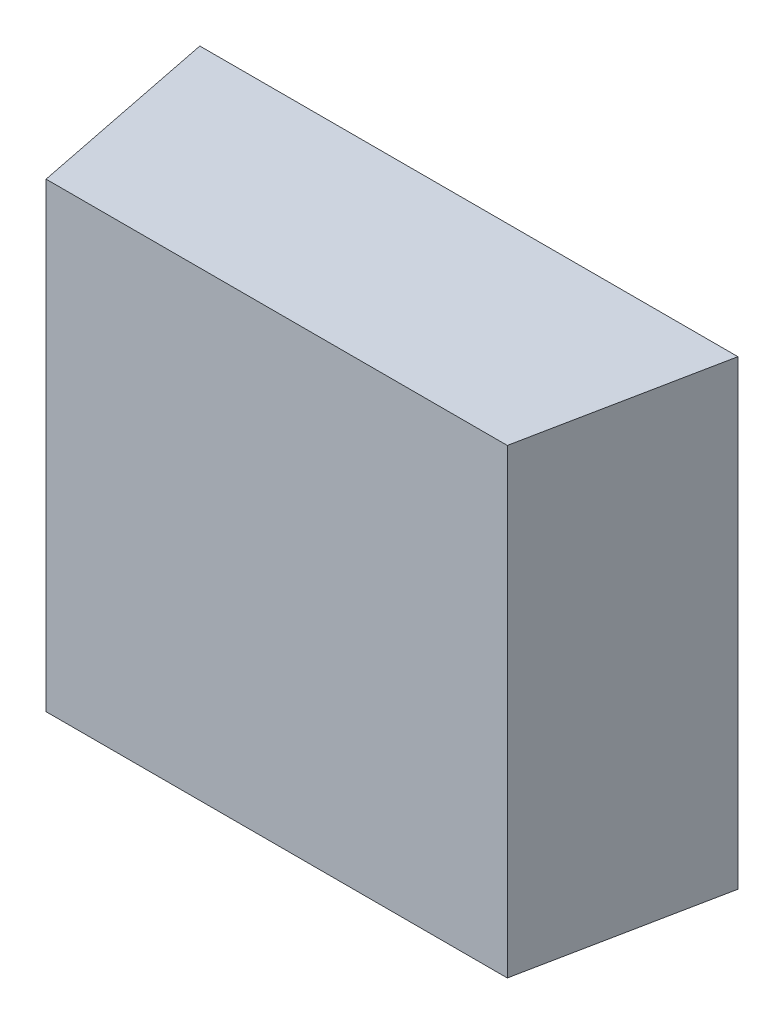
ISO-10303-21;
HEADER;
FILE_DESCRIPTION(('STEP AP214'),'2;1');
FILE_NAME('part.step','',(''),(''),'','','');
FILE_SCHEMA(('AUTOMOTIVE_DESIGN { 1 0 10303 214 1 1 1 1 }'));
ENDSEC;
DATA;
#1=APPLICATION_CONTEXT('core data for automotive mechanical design processes');
#2=APPLICATION_PROTOCOL_DEFINITION('international standard','automotive_design',2000,#1);
#3=PRODUCT_CONTEXT('',#1,'mechanical');
#4=PRODUCT('Part','Part','',(#3));
#5=PRODUCT_RELATED_PRODUCT_CATEGORY('part','',(#4));
#6=PRODUCT_DEFINITION_FORMATION('','',#4);
#7=PRODUCT_DEFINITION_CONTEXT('part definition',#1,'design');
#8=PRODUCT_DEFINITION('design','',#6,#7);
#9=PRODUCT_DEFINITION_SHAPE('','',#8);
#10=(LENGTH_UNIT() NAMED_UNIT(*) SI_UNIT(.MILLI.,.METRE.));
#11=(NAMED_UNIT(*) PLANE_ANGLE_UNIT() SI_UNIT($,.RADIAN.));
#12=(NAMED_UNIT(*) SI_UNIT($,.STERADIAN.) SOLID_ANGLE_UNIT());
#13=UNCERTAINTY_MEASURE_WITH_UNIT(LENGTH_MEASURE(1.E-05),#10,'distance_accuracy_value','');
#14=(GEOMETRIC_REPRESENTATION_CONTEXT(3) GLOBAL_UNCERTAINTY_ASSIGNED_CONTEXT((#13)) GLOBAL_UNIT_ASSIGNED_CONTEXT((#10,
#11,#12)) REPRESENTATION_CONTEXT('',''));
#15=CARTESIAN_POINT('',(0.,0.,0.));
#16=DIRECTION('',(0.,0.,1.));
#17=DIRECTION('',(1.,0.,0.));
#18=AXIS2_PLACEMENT_3D('',#15,#16,#17);
#19=CARTESIAN_POINT('',(0.0339143213787585,-0.927979057558617,0.0911708661417334));
#20=DIRECTION('',(0.,0.,-1.));
#21=DIRECTION('',(-1.,0.,0.));
#22=AXIS2_PLACEMENT_3D('',#19,#20,#21);
#23=PLANE('',#22);
#24=DIRECTION('',(0.,1.,0.));
#25=VECTOR('',#24,1.);
#26=CARTESIAN_POINT('',(0.0358749513000183,-0.927979057558617,0.0911708661417334));
#27=LINE('',#26,#25);
#28=CARTESIAN_POINT('',(0.0358749513000184,-0.929939687479877,0.0911708661417334));
#29=VERTEX_POINT('',#28);
#30=CARTESIAN_POINT('',(0.0358749513000184,-0.969152285905073,0.0911708661417334));
#31=VERTEX_POINT('',#30);
#32=EDGE_CURVE('E20',#29,#31,#27,.F.);
#33=ORIENTED_EDGE('',*,*,#32,.T.);
#34=DIRECTION('',(1.,0.,0.));
#35=VECTOR('',#34,1.);
#36=CARTESIAN_POINT('',(0.030319833189782,-0.969152285905073,0.0911708661417334));
#37=LINE('',#36,#35);
#38=CARTESIAN_POINT('',(0.075087549725215,-0.969152285905073,0.0911708661417334));
#39=VERTEX_POINT('',#38);
#40=EDGE_CURVE('E55',#39,#31,#37,.F.);
#41=ORIENTED_EDGE('',*,*,#40,.F.);
#42=DIRECTION('',(0.,1.,0.));
#43=VECTOR('',#42,1.);
#44=CARTESIAN_POINT('',(0.0750875497252151,-0.927979057558617,0.0911708661417334));
#45=LINE('',#44,#43);
#46=CARTESIAN_POINT('',(0.0750875497252151,-0.929939687479877,0.0911708661417334));
#47=VERTEX_POINT('',#46);
#48=EDGE_CURVE('E76',#39,#47,#45,.T.);
#49=ORIENTED_EDGE('',*,*,#48,.T.);
#50=DIRECTION('',(1.,0.,0.));
#51=VECTOR('',#50,1.);
#52=CARTESIAN_POINT('',(0.030319833189782,-0.929939687479877,0.0911708661417334));
#53=LINE('',#52,#51);
#54=EDGE_CURVE('E58',#47,#29,#53,.F.);
#55=ORIENTED_EDGE('',*,*,#54,.T.);
#56=EDGE_LOOP('',(#33,#41,#49,#55));
#57=FACE_BOUND('',#56,.T.);
#58=ADVANCED_FACE('F17',(#57),#23,.F.);
#59=CARTESIAN_POINT('',(0.0324438489378136,-0.927979057558617,0.0740153543307098));
#60=DIRECTION('',(0.980580675690921,0.,-0.196116135138182));
#61=DIRECTION('',(-0.196116135138182,0.,-0.980580675690921));
#62=AXIS2_PLACEMENT_3D('',#59,#60,#61);
#63=PLANE('',#62);
#64=DIRECTION('',(0.,1.,0.));
#65=VECTOR('',#64,1.);
#66=CARTESIAN_POINT('',(0.0326072347645852,-0.927979057558617,0.0748322834645681));
#67=LINE('',#66,#65);
#68=CARTESIAN_POINT('',(0.0326072347645852,-0.929939687479877,0.0748322834645681));
#69=VERTEX_POINT('',#68);
#70=CARTESIAN_POINT('',(0.0326072347645852,-0.969152285905073,0.0748322834645681));
#71=VERTEX_POINT('',#70);
#72=EDGE_CURVE('E73',#69,#71,#67,.F.);
#73=ORIENTED_EDGE('',*,*,#72,.T.);
#74=DIRECTION('',(-0.196116135138198,0.,-0.980580675690917));
#75=VECTOR('',#74,1.);
#76=CARTESIAN_POINT('',(0.0358749513000185,-0.969152285905073,0.0911708661417334));
#77=LINE('',#76,#75);
#78=EDGE_CURVE('E63',#31,#71,#77,.T.);
#79=ORIENTED_EDGE('',*,*,#78,.F.);
#80=ORIENTED_EDGE('',*,*,#32,.F.);
#81=DIRECTION('',(-0.196116135138198,0.,-0.980580675690917));
#82=VECTOR('',#81,1.);
#83=CARTESIAN_POINT('',(0.0358749513000185,-0.929939687479877,0.0911708661417334));
#84=LINE('',#83,#82);
#85=EDGE_CURVE('E80',#29,#69,#84,.T.);
#86=ORIENTED_EDGE('',*,*,#85,.T.);
#87=EDGE_LOOP('',(#73,#79,#80,#86));
#88=FACE_BOUND('',#87,.T.);
#89=ADVANCED_FACE('F72',(#88),#63,.F.);
#90=CARTESIAN_POINT('',(0.030319833189782,-0.969152285905073,0.0740153543307098));
#91=DIRECTION('',(0.,-1.,0.));
#92=DIRECTION('',(1.,0.,0.));
#93=AXIS2_PLACEMENT_3D('',#90,#91,#92);
#94=PLANE('',#93);
#95=DIRECTION('',(-0.196116135138182,0.,0.980580675690921));
#96=VECTOR('',#95,1.);
#97=CARTESIAN_POINT('',(0.0749241638984435,-0.969152285905073,0.0919877952755917));
#98=LINE('',#97,#96);
#99=CARTESIAN_POINT('',(0.0783552662606484,-0.969152285905073,0.0748322834645681));
#100=VERTEX_POINT('',#99);
#101=EDGE_CURVE('E69',#100,#39,#98,.T.);
#102=ORIENTED_EDGE('',*,*,#101,.T.);
#103=ORIENTED_EDGE('',*,*,#40,.T.);
#104=ORIENTED_EDGE('',*,*,#78,.T.);
#105=DIRECTION('',(1.,0.,0.));
#106=VECTOR('',#105,1.);
#107=CARTESIAN_POINT('',(0.0806426678354515,-0.969152285905073,0.0748322834645681));
#108=LINE('',#107,#106);
#109=EDGE_CURVE('E83',#71,#100,#108,.T.);
#110=ORIENTED_EDGE('',*,*,#109,.T.);
#111=EDGE_LOOP('',(#102,#103,#104,#110));
#112=FACE_BOUND('',#111,.T.);
#113=ADVANCED_FACE('F66',(#112),#94,.T.);
#114=CARTESIAN_POINT('',(0.0749241638984435,-0.927979057558617,0.0919877952755917));
#115=DIRECTION('',(-0.980580675690921,0.,-0.196116135138182));
#116=DIRECTION('',(-0.196116135138182,0.,0.980580675690921));
#117=AXIS2_PLACEMENT_3D('',#114,#115,#116);
#118=PLANE('',#117);
#119=ORIENTED_EDGE('',*,*,#48,.F.);
#120=ORIENTED_EDGE('',*,*,#101,.F.);
#121=DIRECTION('',(0.,1.,0.));
#122=VECTOR('',#121,1.);
#123=CARTESIAN_POINT('',(0.0783552662606484,-0.927979057558617,0.0748322834645681));
#124=LINE('',#123,#122);
#125=CARTESIAN_POINT('',(0.0783552662606483,-0.929939687479877,0.0748322834645681));
#126=VERTEX_POINT('',#125);
#127=EDGE_CURVE('E26',#100,#126,#124,.T.);
#128=ORIENTED_EDGE('',*,*,#127,.T.);
#129=DIRECTION('',(-0.196116135138203,0.,0.980580675690916));
#130=VECTOR('',#129,1.);
#131=CARTESIAN_POINT('',(0.0783552662606484,-0.929939687479877,0.0748322834645681));
#132=LINE('',#131,#130);
#133=EDGE_CURVE('E34',#126,#47,#132,.T.);
#134=ORIENTED_EDGE('',*,*,#133,.T.);
#135=EDGE_LOOP('',(#119,#120,#128,#134));
#136=FACE_BOUND('',#135,.T.);
#137=ADVANCED_FACE('F88',(#136),#118,.F.);
#138=CARTESIAN_POINT('',(0.030319833189782,-0.929939687479877,0.0740153543307098));
#139=DIRECTION('',(0.,-1.,0.));
#140=DIRECTION('',(1.,0.,0.));
#141=AXIS2_PLACEMENT_3D('',#138,#139,#140);
#142=PLANE('',#141);
#143=ORIENTED_EDGE('',*,*,#54,.F.);
#144=ORIENTED_EDGE('',*,*,#133,.F.);
#145=DIRECTION('',(1.,0.,0.));
#146=VECTOR('',#145,1.);
#147=CARTESIAN_POINT('',(0.0806426678354515,-0.929939687479877,0.0748322834645681));
#148=LINE('',#147,#146);
#149=EDGE_CURVE('E11',#126,#69,#148,.F.);
#150=ORIENTED_EDGE('',*,*,#149,.T.);
#151=ORIENTED_EDGE('',*,*,#85,.F.);
#152=EDGE_LOOP('',(#143,#144,#150,#151));
#153=FACE_BOUND('',#152,.T.);
#154=ADVANCED_FACE('F91',(#153),#142,.F.);
#155=CARTESIAN_POINT('',(0.0806426678354515,-0.927979057558617,0.0748322834645681));
#156=DIRECTION('',(0.,0.,1.));
#157=DIRECTION('',(1.,0.,0.));
#158=AXIS2_PLACEMENT_3D('',#155,#156,#157);
#159=PLANE('',#158);
#160=ORIENTED_EDGE('',*,*,#127,.F.);
#161=ORIENTED_EDGE('',*,*,#109,.F.);
#162=ORIENTED_EDGE('',*,*,#72,.F.);
#163=ORIENTED_EDGE('',*,*,#149,.F.);
#164=EDGE_LOOP('',(#160,#161,#162,#163));
#165=FACE_BOUND('',#164,.T.);
#166=ADVANCED_FACE('F90',(#165),#159,.F.);
#167=CLOSED_SHELL('',(#58,#89,#113,#137,#154,#166));
#168=MANIFOLD_SOLID_BREP('B1',#167);
#169=ADVANCED_BREP_SHAPE_REPRESENTATION('',(#18,#168),#14);
#170=SHAPE_DEFINITION_REPRESENTATION(#9,#169);
ENDSEC;
END-ISO-10303-21;
